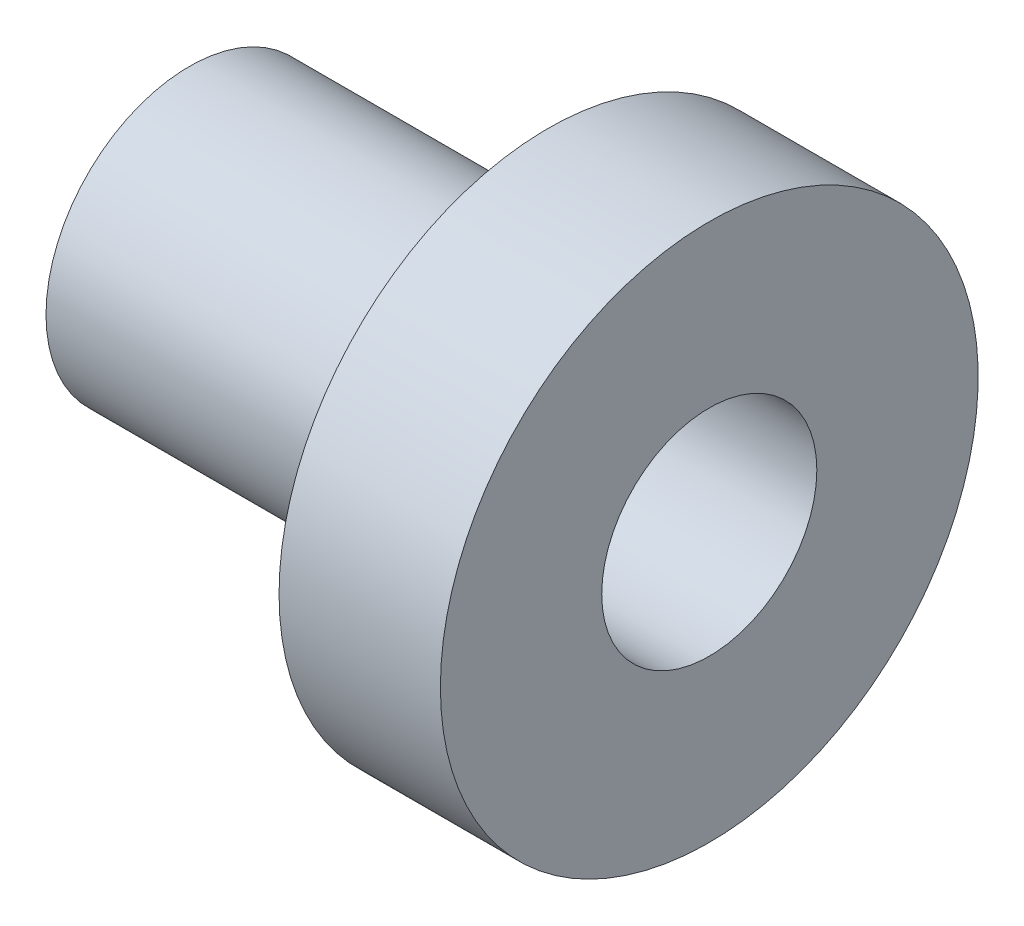
ISO-10303-21;
HEADER;
FILE_DESCRIPTION(('STEP AP214'),'2;1');
FILE_NAME('part.step','',(''),(''),'','','');
FILE_SCHEMA(('AUTOMOTIVE_DESIGN { 1 0 10303 214 1 1 1 1 }'));
ENDSEC;
DATA;
#1=APPLICATION_CONTEXT('core data for automotive mechanical design processes');
#2=APPLICATION_PROTOCOL_DEFINITION('international standard','automotive_design',2000,#1);
#3=PRODUCT_CONTEXT('',#1,'mechanical');
#4=PRODUCT('Part','Part','',(#3));
#5=PRODUCT_RELATED_PRODUCT_CATEGORY('part','',(#4));
#6=PRODUCT_DEFINITION_FORMATION('','',#4);
#7=PRODUCT_DEFINITION_CONTEXT('part definition',#1,'design');
#8=PRODUCT_DEFINITION('design','',#6,#7);
#9=PRODUCT_DEFINITION_SHAPE('','',#8);
#10=(LENGTH_UNIT() NAMED_UNIT(*) SI_UNIT(.MILLI.,.METRE.));
#11=(NAMED_UNIT(*) PLANE_ANGLE_UNIT() SI_UNIT($,.RADIAN.));
#12=(NAMED_UNIT(*) SI_UNIT($,.STERADIAN.) SOLID_ANGLE_UNIT());
#13=UNCERTAINTY_MEASURE_WITH_UNIT(LENGTH_MEASURE(1.E-05),#10,'distance_accuracy_value','');
#14=(GEOMETRIC_REPRESENTATION_CONTEXT(3) GLOBAL_UNCERTAINTY_ASSIGNED_CONTEXT((#13)) GLOBAL_UNIT_ASSIGNED_CONTEXT((#10,
#11,#12)) REPRESENTATION_CONTEXT('',''));
#15=CARTESIAN_POINT('',(0.,0.,0.));
#16=DIRECTION('',(0.,0.,1.));
#17=DIRECTION('',(1.,0.,0.));
#18=AXIS2_PLACEMENT_3D('',#15,#16,#17);
#19=CARTESIAN_POINT('',(-9.,15.,0.));
#20=DIRECTION('',(1.,0.,0.));
#21=DIRECTION('',(0.,0.,-1.));
#22=AXIS2_PLACEMENT_3D('',#19,#20,#21);
#23=PLANE('',#22);
#24=CARTESIAN_POINT('',(-9.,0.,0.));
#25=DIRECTION('',(-1.,0.,0.));
#26=DIRECTION('',(0.,0.,1.));
#27=AXIS2_PLACEMENT_3D('',#24,#25,#26);
#28=CIRCLE('',#27,8.);
#29=CARTESIAN_POINT('',(-9.,0.,8.));
#30=VERTEX_POINT('',#29);
#31=EDGE_CURVE('E53',#30,#30,#28,.T.);
#32=ORIENTED_EDGE('',*,*,#31,.F.);
#33=EDGE_LOOP('',(#32));
#34=FACE_BOUND('',#33,.T.);
#35=CARTESIAN_POINT('',(-9.,0.,0.));
#36=DIRECTION('',(-1.,0.,0.));
#37=DIRECTION('',(0.,0.,1.));
#38=AXIS2_PLACEMENT_3D('',#35,#36,#37);
#39=CIRCLE('',#38,15.);
#40=CARTESIAN_POINT('',(-9.,0.,15.));
#41=VERTEX_POINT('',#40);
#42=EDGE_CURVE('E10',#41,#41,#39,.T.);
#43=ORIENTED_EDGE('',*,*,#42,.T.);
#44=EDGE_LOOP('',(#43));
#45=FACE_BOUND('',#44,.T.);
#46=ADVANCED_FACE('F31',(#34,#45),#23,.F.);
#47=CARTESIAN_POINT('',(-32.3890495381356,0.,0.));
#48=DIRECTION('',(-1.,0.,0.));
#49=DIRECTION('',(0.,0.,1.));
#50=AXIS2_PLACEMENT_3D('',#47,#48,#49);
#51=CYLINDRICAL_SURFACE('',#50,15.);
#52=ORIENTED_EDGE('',*,*,#42,.F.);
#53=EDGE_LOOP('',(#52));
#54=FACE_BOUND('',#53,.T.);
#55=CARTESIAN_POINT('',(0.,0.,0.));
#56=DIRECTION('',(-1.,0.,0.));
#57=DIRECTION('',(0.,0.,1.));
#58=AXIS2_PLACEMENT_3D('',#55,#56,#57);
#59=CIRCLE('',#58,15.);
#60=CARTESIAN_POINT('',(0.,0.,15.));
#61=VERTEX_POINT('',#60);
#62=EDGE_CURVE('E37',#61,#61,#59,.T.);
#63=ORIENTED_EDGE('',*,*,#62,.T.);
#64=EDGE_LOOP('',(#63));
#65=FACE_BOUND('',#64,.T.);
#66=ADVANCED_FACE('F60',(#54,#65),#51,.T.);
#67=CARTESIAN_POINT('',(0.,15.,0.));
#68=DIRECTION('',(-1.,0.,0.));
#69=DIRECTION('',(0.,0.,1.));
#70=AXIS2_PLACEMENT_3D('',#67,#68,#69);
#71=PLANE('',#70);
#72=ORIENTED_EDGE('',*,*,#62,.F.);
#73=EDGE_LOOP('',(#72));
#74=FACE_BOUND('',#73,.T.);
#75=CARTESIAN_POINT('',(0.,0.,0.));
#76=DIRECTION('',(-1.,0.,0.));
#77=DIRECTION('',(0.,0.,1.));
#78=AXIS2_PLACEMENT_3D('',#75,#76,#77);
#79=CIRCLE('',#78,6.);
#80=CARTESIAN_POINT('',(0.,0.,6.));
#81=VERTEX_POINT('',#80);
#82=EDGE_CURVE('E41',#81,#81,#79,.T.);
#83=ORIENTED_EDGE('',*,*,#82,.T.);
#84=EDGE_LOOP('',(#83));
#85=FACE_BOUND('',#84,.T.);
#86=ADVANCED_FACE('F64',(#74,#85),#71,.F.);
#87=CARTESIAN_POINT('',(-32.3890495381356,0.,0.));
#88=DIRECTION('',(-1.,0.,0.));
#89=DIRECTION('',(0.,0.,1.));
#90=AXIS2_PLACEMENT_3D('',#87,#88,#89);
#91=CYLINDRICAL_SURFACE('',#90,5.99999999999999);
#92=ORIENTED_EDGE('',*,*,#82,.F.);
#93=EDGE_LOOP('',(#92));
#94=FACE_BOUND('',#93,.T.);
#95=CARTESIAN_POINT('',(-29.,0.,0.));
#96=DIRECTION('',(-1.,0.,0.));
#97=DIRECTION('',(0.,0.,1.));
#98=AXIS2_PLACEMENT_3D('',#95,#96,#97);
#99=CIRCLE('',#98,5.99999999999999);
#100=CARTESIAN_POINT('',(-29.,0.,5.99999999999999));
#101=VERTEX_POINT('',#100);
#102=EDGE_CURVE('E45',#101,#101,#99,.T.);
#103=ORIENTED_EDGE('',*,*,#102,.T.);
#104=EDGE_LOOP('',(#103));
#105=FACE_BOUND('',#104,.T.);
#106=ADVANCED_FACE('F69',(#94,#105),#91,.F.);
#107=CARTESIAN_POINT('',(-29.,7.99999999999999,0.));
#108=DIRECTION('',(1.,0.,0.));
#109=DIRECTION('',(0.,0.,-1.));
#110=AXIS2_PLACEMENT_3D('',#107,#108,#109);
#111=PLANE('',#110);
#112=ORIENTED_EDGE('',*,*,#102,.F.);
#113=EDGE_LOOP('',(#112));
#114=FACE_BOUND('',#113,.T.);
#115=CARTESIAN_POINT('',(-29.,0.,0.));
#116=DIRECTION('',(-1.,0.,0.));
#117=DIRECTION('',(0.,0.,1.));
#118=AXIS2_PLACEMENT_3D('',#115,#116,#117);
#119=CIRCLE('',#118,7.99999999999999);
#120=CARTESIAN_POINT('',(-29.,0.,7.99999999999999));
#121=VERTEX_POINT('',#120);
#122=EDGE_CURVE('E50',#121,#121,#119,.T.);
#123=ORIENTED_EDGE('',*,*,#122,.T.);
#124=EDGE_LOOP('',(#123));
#125=FACE_BOUND('',#124,.T.);
#126=ADVANCED_FACE('F75',(#114,#125),#111,.F.);
#127=CARTESIAN_POINT('',(-32.3890495381356,0.,0.));
#128=DIRECTION('',(-1.,0.,0.));
#129=DIRECTION('',(0.,0.,1.));
#130=AXIS2_PLACEMENT_3D('',#127,#128,#129);
#131=CYLINDRICAL_SURFACE('',#130,8.);
#132=ORIENTED_EDGE('',*,*,#122,.F.);
#133=EDGE_LOOP('',(#132));
#134=FACE_BOUND('',#133,.T.);
#135=ORIENTED_EDGE('',*,*,#31,.T.);
#136=EDGE_LOOP('',(#135));
#137=FACE_BOUND('',#136,.T.);
#138=ADVANCED_FACE('F57',(#134,#137),#131,.T.);
#139=CLOSED_SHELL('',(#46,#66,#86,#106,#126,#138));
#140=MANIFOLD_SOLID_BREP('B2',#139);
#141=ADVANCED_BREP_SHAPE_REPRESENTATION('',(#18,#140),#14);
#142=SHAPE_DEFINITION_REPRESENTATION(#9,#141);
ENDSEC;
END-ISO-10303-21;
